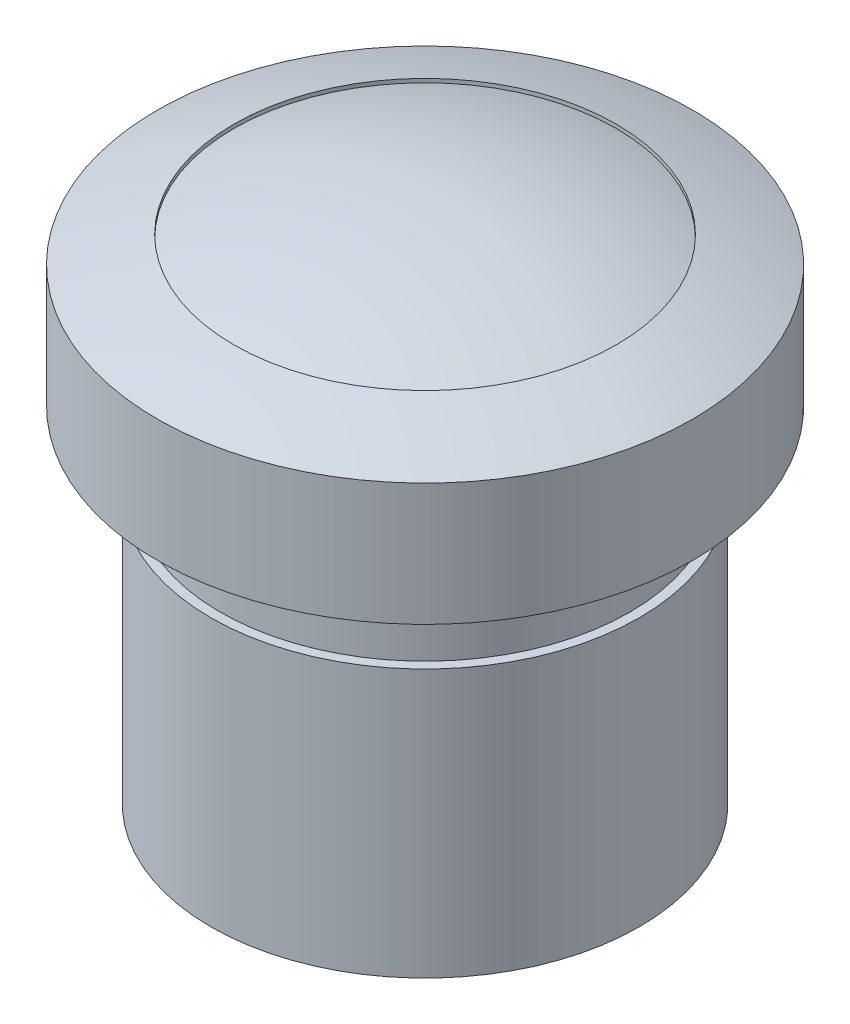
ISO-10303-21;
HEADER;
FILE_DESCRIPTION(('STEP AP214'),'2;1');
FILE_NAME('part.step','',(''),(''),'','','');
FILE_SCHEMA(('AUTOMOTIVE_DESIGN { 1 0 10303 214 1 1 1 1 }'));
ENDSEC;
DATA;
#1=APPLICATION_CONTEXT('core data for automotive mechanical design processes');
#2=APPLICATION_PROTOCOL_DEFINITION('international standard','automotive_design',2000,#1);
#3=PRODUCT_CONTEXT('',#1,'mechanical');
#4=PRODUCT('Part','Part','',(#3));
#5=PRODUCT_RELATED_PRODUCT_CATEGORY('part','',(#4));
#6=PRODUCT_DEFINITION_FORMATION('','',#4);
#7=PRODUCT_DEFINITION_CONTEXT('part definition',#1,'design');
#8=PRODUCT_DEFINITION('design','',#6,#7);
#9=PRODUCT_DEFINITION_SHAPE('','',#8);
#10=(LENGTH_UNIT() NAMED_UNIT(*) SI_UNIT(.MILLI.,.METRE.));
#11=(NAMED_UNIT(*) PLANE_ANGLE_UNIT() SI_UNIT($,.RADIAN.));
#12=(NAMED_UNIT(*) SI_UNIT($,.STERADIAN.) SOLID_ANGLE_UNIT());
#13=UNCERTAINTY_MEASURE_WITH_UNIT(LENGTH_MEASURE(1.E-05),#10,'distance_accuracy_value','');
#14=(GEOMETRIC_REPRESENTATION_CONTEXT(3) GLOBAL_UNCERTAINTY_ASSIGNED_CONTEXT((#13)) GLOBAL_UNIT_ASSIGNED_CONTEXT((#10,
#11,#12)) REPRESENTATION_CONTEXT('',''));
#15=CARTESIAN_POINT('',(0.,0.,0.));
#16=DIRECTION('',(0.,0.,1.));
#17=DIRECTION('',(1.,0.,0.));
#18=AXIS2_PLACEMENT_3D('',#15,#16,#17);
#19=CARTESIAN_POINT('',(0.,22.2735064736294,0.));
#20=DIRECTION('',(0.,-1.,0.));
#21=DIRECTION('',(0.,0.,-1.));
#22=AXIS2_PLACEMENT_3D('',#19,#20,#21);
#23=CYLINDRICAL_SURFACE('',#22,5.4);
#24=CARTESIAN_POINT('',(0.,0.,0.));
#25=DIRECTION('',(0.,-1.,0.));
#26=DIRECTION('',(0.,0.,-1.));
#27=AXIS2_PLACEMENT_3D('',#24,#25,#26);
#28=CIRCLE('',#27,5.4);
#29=CARTESIAN_POINT('',(-3.29118425669793,0.,-4.28113375035909));
#30=VERTEX_POINT('',#29);
#31=CARTESIAN_POINT('',(3.29118425669792,0.,-4.2811337503591));
#32=VERTEX_POINT('',#31);
#33=EDGE_CURVE('E313',#30,#32,#28,.T.);
#34=ORIENTED_EDGE('',*,*,#33,.T.);
#35=DIRECTION('',(0.,-1.,0.));
#36=VECTOR('',#35,1.);
#37=CARTESIAN_POINT('',(3.29118425669792,18.1088748241821,-4.2811337503591));
#38=LINE('',#37,#36);
#39=CARTESIAN_POINT('',(3.29118425669792,6.,-4.2811337503591));
#40=VERTEX_POINT('',#39);
#41=EDGE_CURVE('E222',#40,#32,#38,.T.);
#42=ORIENTED_EDGE('',*,*,#41,.F.);
#43=CARTESIAN_POINT('',(0.,6.,0.));
#44=DIRECTION('',(0.,-1.,0.));
#45=DIRECTION('',(1.,0.,0.));
#46=AXIS2_PLACEMENT_3D('',#43,#44,#45);
#47=CIRCLE('',#46,5.4);
#48=CARTESIAN_POINT('',(-3.29118425669793,6.,-4.28113375035909));
#49=VERTEX_POINT('',#48);
#50=EDGE_CURVE('E321',#40,#49,#47,.F.);
#51=ORIENTED_EDGE('',*,*,#50,.T.);
#52=DIRECTION('',(0.,-1.,0.));
#53=VECTOR('',#52,1.);
#54=CARTESIAN_POINT('',(-3.29118425669792,18.1088748241821,-4.28113375035909));
#55=LINE('',#54,#53);
#56=EDGE_CURVE('E61',#49,#30,#55,.T.);
#57=ORIENTED_EDGE('',*,*,#56,.T.);
#58=EDGE_LOOP('',(#34,#42,#51,#57));
#59=FACE_BOUND('',#58,.T.);
#60=ADVANCED_FACE('F38',(#59),#23,.F.);
#61=CARTESIAN_POINT('',(-4.28113375035909,0.,3.29118425669793));
#62=VERTEX_POINT('',#61);
#63=CARTESIAN_POINT('',(-4.28113375035909,0.,-3.29118425669793));
#64=VERTEX_POINT('',#63);
#65=EDGE_CURVE('E315',#62,#64,#28,.T.);
#66=ORIENTED_EDGE('',*,*,#65,.T.);
#67=DIRECTION('',(0.,-1.,0.));
#68=VECTOR('',#67,1.);
#69=CARTESIAN_POINT('',(-4.28113375035909,18.1088748241821,-3.29118425669793));
#70=LINE('',#69,#68);
#71=CARTESIAN_POINT('',(-4.28113375035909,6.,-3.29118425669793));
#72=VERTEX_POINT('',#71);
#73=EDGE_CURVE('E286',#72,#64,#70,.T.);
#74=ORIENTED_EDGE('',*,*,#73,.F.);
#75=CARTESIAN_POINT('',(-4.28113375035909,6.,3.29118425669793));
#76=VERTEX_POINT('',#75);
#77=EDGE_CURVE('E487',#72,#76,#47,.F.);
#78=ORIENTED_EDGE('',*,*,#77,.T.);
#79=DIRECTION('',(0.,-1.,0.));
#80=VECTOR('',#79,1.);
#81=CARTESIAN_POINT('',(-4.28113375035909,18.1088748241821,3.29118425669793));
#82=LINE('',#81,#80);
#83=EDGE_CURVE('E293',#76,#62,#82,.T.);
#84=ORIENTED_EDGE('',*,*,#83,.T.);
#85=EDGE_LOOP('',(#66,#74,#78,#84));
#86=FACE_BOUND('',#85,.T.);
#87=ADVANCED_FACE('F374',(#86),#23,.F.);
#88=CARTESIAN_POINT('',(3.29118425669793,0.,4.28113375035909));
#89=VERTEX_POINT('',#88);
#90=CARTESIAN_POINT('',(-3.29118425669792,0.,4.2811337503591));
#91=VERTEX_POINT('',#90);
#92=EDGE_CURVE('E405',#89,#91,#28,.T.);
#93=ORIENTED_EDGE('',*,*,#92,.T.);
#94=DIRECTION('',(0.,-1.,0.));
#95=VECTOR('',#94,1.);
#96=CARTESIAN_POINT('',(-3.29118425669792,18.1088748241821,4.2811337503591));
#97=LINE('',#96,#95);
#98=CARTESIAN_POINT('',(-3.29118425669792,6.,4.2811337503591));
#99=VERTEX_POINT('',#98);
#100=EDGE_CURVE('E295',#99,#91,#97,.T.);
#101=ORIENTED_EDGE('',*,*,#100,.F.);
#102=CARTESIAN_POINT('',(3.29118425669793,6.,4.28113375035909));
#103=VERTEX_POINT('',#102);
#104=EDGE_CURVE('E320',#99,#103,#47,.F.);
#105=ORIENTED_EDGE('',*,*,#104,.T.);
#106=DIRECTION('',(0.,-1.,0.));
#107=VECTOR('',#106,1.);
#108=CARTESIAN_POINT('',(3.29118425669793,18.1088748241821,4.28113375035909));
#109=LINE('',#108,#107);
#110=EDGE_CURVE('E302',#103,#89,#109,.T.);
#111=ORIENTED_EDGE('',*,*,#110,.T.);
#112=EDGE_LOOP('',(#93,#101,#105,#111));
#113=FACE_BOUND('',#112,.T.);
#114=ADVANCED_FACE('F380',(#113),#23,.F.);
#115=CARTESIAN_POINT('',(0.,6.,0.));
#116=DIRECTION('',(0.,-1.,0.));
#117=DIRECTION('',(1.,0.,0.));
#118=AXIS2_PLACEMENT_3D('',#115,#116,#117);
#119=PLANE('',#118);
#120=DIRECTION('',(-0.707106781186546,0.,0.707106781186549));
#121=VECTOR('',#120,1.);
#122=CARTESIAN_POINT('',(3.29118425669792,6.,-4.2811337503591));
#123=LINE('',#122,#121);
#124=CARTESIAN_POINT('',(1.66005050633883,6.,-2.65));
#125=VERTEX_POINT('',#124);
#126=EDGE_CURVE('E240',#40,#125,#123,.T.);
#127=ORIENTED_EDGE('',*,*,#126,.T.);
#128=DIRECTION('',(-1.,0.,0.));
#129=VECTOR('',#128,1.);
#130=CARTESIAN_POINT('',(1.66005050633883,6.,-2.65));
#131=LINE('',#130,#129);
#132=CARTESIAN_POINT('',(-1.66005050633883,6.,-2.65));
#133=VERTEX_POINT('',#132);
#134=EDGE_CURVE('E238',#125,#133,#131,.T.);
#135=ORIENTED_EDGE('',*,*,#134,.T.);
#136=DIRECTION('',(-0.707106781186547,0.,-0.707106781186548));
#137=VECTOR('',#136,1.);
#138=CARTESIAN_POINT('',(-1.66005050633883,6.,-2.65));
#139=LINE('',#138,#137);
#140=EDGE_CURVE('E236',#133,#49,#139,.T.);
#141=ORIENTED_EDGE('',*,*,#140,.T.);
#142=ORIENTED_EDGE('',*,*,#50,.F.);
#143=EDGE_LOOP('',(#127,#135,#141,#142));
#144=FACE_BOUND('',#143,.T.);
#145=ADVANCED_FACE('F393',(#144),#119,.T.);
#146=DIRECTION('',(0.707106781186548,0.,0.707106781186547));
#147=VECTOR('',#146,1.);
#148=CARTESIAN_POINT('',(-2.65,6.,-1.66005050633883));
#149=LINE('',#148,#147);
#150=CARTESIAN_POINT('',(-2.65,6.,-1.66005050633883));
#151=VERTEX_POINT('',#150);
#152=EDGE_CURVE('E234',#72,#151,#149,.T.);
#153=ORIENTED_EDGE('',*,*,#152,.T.);
#154=DIRECTION('',(0.,0.,1.));
#155=VECTOR('',#154,1.);
#156=CARTESIAN_POINT('',(-2.65,6.,-1.66005050633883));
#157=LINE('',#156,#155);
#158=CARTESIAN_POINT('',(-2.65,6.,1.66005050633883));
#159=VERTEX_POINT('',#158);
#160=EDGE_CURVE('E232',#151,#159,#157,.T.);
#161=ORIENTED_EDGE('',*,*,#160,.T.);
#162=DIRECTION('',(-0.707106781186548,0.,0.707106781186547));
#163=VECTOR('',#162,1.);
#164=CARTESIAN_POINT('',(-2.65,6.,1.66005050633883));
#165=LINE('',#164,#163);
#166=EDGE_CURVE('E230',#159,#76,#165,.T.);
#167=ORIENTED_EDGE('',*,*,#166,.T.);
#168=ORIENTED_EDGE('',*,*,#77,.F.);
#169=EDGE_LOOP('',(#153,#161,#167,#168));
#170=FACE_BOUND('',#169,.T.);
#171=ADVANCED_FACE('F402',(#170),#119,.T.);
#172=DIRECTION('',(0.707106781186546,0.,-0.707106781186549));
#173=VECTOR('',#172,1.);
#174=CARTESIAN_POINT('',(-1.66005050633883,6.,2.65));
#175=LINE('',#174,#173);
#176=CARTESIAN_POINT('',(-1.66005050633883,6.,2.65));
#177=VERTEX_POINT('',#176);
#178=EDGE_CURVE('E228',#99,#177,#175,.T.);
#179=ORIENTED_EDGE('',*,*,#178,.T.);
#180=DIRECTION('',(1.,0.,0.));
#181=VECTOR('',#180,1.);
#182=CARTESIAN_POINT('',(1.66005050633884,6.,2.65));
#183=LINE('',#182,#181);
#184=CARTESIAN_POINT('',(1.66005050633883,6.,2.65));
#185=VERTEX_POINT('',#184);
#186=EDGE_CURVE('E226',#177,#185,#183,.T.);
#187=ORIENTED_EDGE('',*,*,#186,.T.);
#188=DIRECTION('',(0.707106781186548,0.,0.707106781186547));
#189=VECTOR('',#188,1.);
#190=CARTESIAN_POINT('',(1.66005050633883,6.,2.65));
#191=LINE('',#190,#189);
#192=EDGE_CURVE('E224',#185,#103,#191,.T.);
#193=ORIENTED_EDGE('',*,*,#192,.T.);
#194=ORIENTED_EDGE('',*,*,#104,.F.);
#195=EDGE_LOOP('',(#179,#187,#193,#194));
#196=FACE_BOUND('',#195,.T.);
#197=ADVANCED_FACE('F394',(#196),#119,.T.);
#198=CARTESIAN_POINT('',(0.,9.,0.));
#199=DIRECTION('',(0.,1.,0.));
#200=DIRECTION('',(-1.,0.,0.));
#201=AXIS2_PLACEMENT_3D('',#198,#199,#200);
#202=PLANE('',#201);
#203=CARTESIAN_POINT('',(0.,9.,0.));
#204=DIRECTION('',(0.,-1.,0.));
#205=DIRECTION('',(1.,0.,0.));
#206=AXIS2_PLACEMENT_3D('',#203,#204,#205);
#207=CIRCLE('',#206,7.);
#208=CARTESIAN_POINT('',(7.,9.00000000000001,0.));
#209=VERTEX_POINT('',#208);
#210=EDGE_CURVE('E46',#209,#209,#207,.T.);
#211=ORIENTED_EDGE('',*,*,#210,.T.);
#212=EDGE_LOOP('',(#211));
#213=FACE_BOUND('',#212,.T.);
#214=CARTESIAN_POINT('',(0.,9.,0.));
#215=DIRECTION('',(0.,-1.,0.));
#216=DIRECTION('',(1.,0.,0.));
#217=AXIS2_PLACEMENT_3D('',#214,#215,#216);
#218=CIRCLE('',#217,5.35);
#219=CARTESIAN_POINT('',(5.35,9.00000000000001,0.));
#220=VERTEX_POINT('',#219);
#221=EDGE_CURVE('E326',#220,#220,#218,.T.);
#222=ORIENTED_EDGE('',*,*,#221,.F.);
#223=EDGE_LOOP('',(#222));
#224=FACE_BOUND('',#223,.T.);
#225=ADVANCED_FACE('F342',(#213,#224),#202,.F.);
#226=CARTESIAN_POINT('',(0.,9.,0.));
#227=DIRECTION('',(0.,-1.,0.));
#228=DIRECTION('',(1.,0.,0.));
#229=AXIS2_PLACEMENT_3D('',#226,#227,#228);
#230=CYLINDRICAL_SURFACE('',#229,7.);
#231=ORIENTED_EDGE('',*,*,#210,.F.);
#232=EDGE_LOOP('',(#231));
#233=FACE_BOUND('',#232,.T.);
#234=CARTESIAN_POINT('',(0.,12.2,0.));
#235=DIRECTION('',(0.,-1.,0.));
#236=DIRECTION('',(1.,0.,0.));
#237=AXIS2_PLACEMENT_3D('',#234,#235,#236);
#238=CIRCLE('',#237,7.);
#239=CARTESIAN_POINT('',(7.,12.2,0.));
#240=VERTEX_POINT('',#239);
#241=EDGE_CURVE('E337',#240,#240,#238,.T.);
#242=ORIENTED_EDGE('',*,*,#241,.T.);
#243=EDGE_LOOP('',(#242));
#244=FACE_BOUND('',#243,.T.);
#245=ADVANCED_FACE('F345',(#233,#244),#230,.T.);
#246=CARTESIAN_POINT('',(0.,-7.54699942395465,0.));
#247=DIRECTION('',(0.,-1.,0.));
#248=DIRECTION('',(1.,0.,0.));
#249=AXIS2_PLACEMENT_3D('',#246,#247,#248);
#250=DEGENERATE_TOROIDAL_SURFACE('',#249,0.84161962045238,21.2469994239546,.F.);
#251=ORIENTED_EDGE('',*,*,#241,.F.);
#252=EDGE_LOOP('',(#251));
#253=FACE_BOUND('',#252,.T.);
#254=CARTESIAN_POINT('',(0.,12.8811787799742,0.));
#255=DIRECTION('',(0.,-1.,0.));
#256=DIRECTION('',(1.,0.,0.));
#257=AXIS2_PLACEMENT_3D('',#254,#255,#256);
#258=CIRCLE('',#257,5.);
#259=CARTESIAN_POINT('',(5.,12.8811787799742,0.));
#260=VERTEX_POINT('',#259);
#261=EDGE_CURVE('E334',#260,#260,#258,.T.);
#262=ORIENTED_EDGE('',*,*,#261,.T.);
#263=EDGE_LOOP('',(#262));
#264=FACE_BOUND('',#263,.T.);
#265=ADVANCED_FACE('F348',(#253,#264),#250,.F.);
#266=CARTESIAN_POINT('',(0.,9.,0.));
#267=DIRECTION('',(0.,-1.,0.));
#268=DIRECTION('',(1.,0.,0.));
#269=AXIS2_PLACEMENT_3D('',#266,#267,#268);
#270=CYLINDRICAL_SURFACE('',#269,5.);
#271=ORIENTED_EDGE('',*,*,#261,.F.);
#272=EDGE_LOOP('',(#271));
#273=FACE_BOUND('',#272,.T.);
#274=CARTESIAN_POINT('',(0.,12.7811787799742,0.));
#275=DIRECTION('',(0.,-1.,0.));
#276=DIRECTION('',(1.,0.,0.));
#277=AXIS2_PLACEMENT_3D('',#274,#275,#276);
#278=CIRCLE('',#277,5.);
#279=CARTESIAN_POINT('',(5.,12.7811787799742,0.));
#280=VERTEX_POINT('',#279);
#281=EDGE_CURVE('E331',#280,#280,#278,.T.);
#282=ORIENTED_EDGE('',*,*,#281,.T.);
#283=EDGE_LOOP('',(#282));
#284=FACE_BOUND('',#283,.T.);
#285=ADVANCED_FACE('F354',(#273,#284),#270,.F.);
#286=CARTESIAN_POINT('',(0.,-0.363798196587588,0.));
#287=DIRECTION('',(0.,-1.,0.));
#288=DIRECTION('',(1.,0.,0.));
#289=AXIS2_PLACEMENT_3D('',#286,#287,#288);
#290=SPHERICAL_SURFACE('',#289,14.0637981965876);
#291=ORIENTED_EDGE('',*,*,#281,.F.);
#292=EDGE_LOOP('',(#291));
#293=FACE_BOUND('',#292,.T.);
#294=ADVANCED_FACE('F360',(#293),#290,.T.);
#295=CARTESIAN_POINT('',(0.,7.,0.));
#296=DIRECTION('',(0.,-1.,0.));
#297=DIRECTION('',(1.,0.,0.));
#298=AXIS2_PLACEMENT_3D('',#295,#296,#297);
#299=PLANE('',#298);
#300=CARTESIAN_POINT('',(0.,7.,0.));
#301=DIRECTION('',(0.,-1.,0.));
#302=DIRECTION('',(1.,0.,0.));
#303=AXIS2_PLACEMENT_3D('',#300,#301,#302);
#304=CIRCLE('',#303,5.6);
#305=CARTESIAN_POINT('',(5.6,7.,0.));
#306=VERTEX_POINT('',#305);
#307=EDGE_CURVE('E325',#306,#306,#304,.T.);
#308=ORIENTED_EDGE('',*,*,#307,.F.);
#309=EDGE_LOOP('',(#308));
#310=FACE_BOUND('',#309,.T.);
#311=CARTESIAN_POINT('',(0.,7.,0.));
#312=DIRECTION('',(0.,-1.,0.));
#313=DIRECTION('',(1.,0.,0.));
#314=AXIS2_PLACEMENT_3D('',#311,#312,#313);
#315=CIRCLE('',#314,5.35);
#316=CARTESIAN_POINT('',(5.35,7.,0.));
#317=VERTEX_POINT('',#316);
#318=EDGE_CURVE('E322',#317,#317,#315,.T.);
#319=ORIENTED_EDGE('',*,*,#318,.T.);
#320=EDGE_LOOP('',(#319));
#321=FACE_BOUND('',#320,.T.);
#322=ADVANCED_FACE('F365',(#310,#321),#299,.F.);
#323=CARTESIAN_POINT('',(0.,7.,0.));
#324=DIRECTION('',(0.,1.,0.));
#325=DIRECTION('',(-1.,0.,0.));
#326=AXIS2_PLACEMENT_3D('',#323,#324,#325);
#327=CYLINDRICAL_SURFACE('',#326,5.35);
#328=ORIENTED_EDGE('',*,*,#318,.F.);
#329=EDGE_LOOP('',(#328));
#330=FACE_BOUND('',#329,.T.);
#331=ORIENTED_EDGE('',*,*,#221,.T.);
#332=EDGE_LOOP('',(#331));
#333=FACE_BOUND('',#332,.T.);
#334=ADVANCED_FACE('F370',(#330,#333),#327,.T.);
#335=CARTESIAN_POINT('',(0.,0.,0.));
#336=DIRECTION('',(0.,1.,0.));
#337=DIRECTION('',(0.,0.,1.));
#338=AXIS2_PLACEMENT_3D('',#335,#336,#337);
#339=PLANE('',#338);
#340=DIRECTION('',(1.,0.,0.));
#341=VECTOR('',#340,1.);
#342=CARTESIAN_POINT('',(2.25,0.,-2.25));
#343=LINE('',#342,#341);
#344=CARTESIAN_POINT('',(-2.25,0.,-2.25));
#345=VERTEX_POINT('',#344);
#346=CARTESIAN_POINT('',(2.25,0.,-2.25));
#347=VERTEX_POINT('',#346);
#348=EDGE_CURVE('E208',#345,#347,#343,.T.);
#349=ORIENTED_EDGE('',*,*,#348,.F.);
#350=DIRECTION('',(0.,0.,-1.));
#351=VECTOR('',#350,1.);
#352=CARTESIAN_POINT('',(-2.25,0.,-2.25));
#353=LINE('',#352,#351);
#354=CARTESIAN_POINT('',(-2.25,0.,2.25));
#355=VERTEX_POINT('',#354);
#356=EDGE_CURVE('E53',#355,#345,#353,.T.);
#357=ORIENTED_EDGE('',*,*,#356,.F.);
#358=DIRECTION('',(-1.,0.,0.));
#359=VECTOR('',#358,1.);
#360=CARTESIAN_POINT('',(2.25,0.,2.25));
#361=LINE('',#360,#359);
#362=CARTESIAN_POINT('',(2.25,0.,2.25));
#363=VERTEX_POINT('',#362);
#364=EDGE_CURVE('E196',#363,#355,#361,.T.);
#365=ORIENTED_EDGE('',*,*,#364,.F.);
#366=DIRECTION('',(0.,0.,1.));
#367=VECTOR('',#366,1.);
#368=CARTESIAN_POINT('',(2.25,0.,-2.25));
#369=LINE('',#368,#367);
#370=EDGE_CURVE('E199',#347,#363,#369,.T.);
#371=ORIENTED_EDGE('',*,*,#370,.F.);
#372=EDGE_LOOP('',(#349,#357,#365,#371));
#373=FACE_BOUND('',#372,.T.);
#374=ORIENTED_EDGE('',*,*,#33,.F.);
#375=DIRECTION('',(0.707106781186547,0.,0.707106781186548));
#376=VECTOR('',#375,1.);
#377=CARTESIAN_POINT('',(-1.66005050633883,0.,-2.65));
#378=LINE('',#377,#376);
#379=CARTESIAN_POINT('',(-1.66005050633883,0.,-2.65));
#380=VERTEX_POINT('',#379);
#381=EDGE_CURVE('E269',#30,#380,#378,.T.);
#382=ORIENTED_EDGE('',*,*,#381,.T.);
#383=DIRECTION('',(1.,0.,0.));
#384=VECTOR('',#383,1.);
#385=CARTESIAN_POINT('',(1.66005050633883,0.,-2.65));
#386=LINE('',#385,#384);
#387=CARTESIAN_POINT('',(1.66005050633883,0.,-2.65));
#388=VERTEX_POINT('',#387);
#389=EDGE_CURVE('E272',#380,#388,#386,.T.);
#390=ORIENTED_EDGE('',*,*,#389,.T.);
#391=DIRECTION('',(0.707106781186546,0.,-0.707106781186549));
#392=VECTOR('',#391,1.);
#393=CARTESIAN_POINT('',(3.29118425669792,0.,-4.2811337503591));
#394=LINE('',#393,#392);
#395=EDGE_CURVE('E275',#388,#32,#394,.T.);
#396=ORIENTED_EDGE('',*,*,#395,.T.);
#397=EDGE_LOOP('',(#374,#382,#390,#396));
#398=FACE_BOUND('',#397,.T.);
#399=ORIENTED_EDGE('',*,*,#65,.F.);
#400=DIRECTION('',(0.707106781186548,0.,-0.707106781186547));
#401=VECTOR('',#400,1.);
#402=CARTESIAN_POINT('',(-2.65,0.,1.66005050633883));
#403=LINE('',#402,#401);
#404=CARTESIAN_POINT('',(-2.65,0.,1.66005050633883));
#405=VERTEX_POINT('',#404);
#406=EDGE_CURVE('E260',#62,#405,#403,.T.);
#407=ORIENTED_EDGE('',*,*,#406,.T.);
#408=DIRECTION('',(0.,0.,-1.));
#409=VECTOR('',#408,1.);
#410=CARTESIAN_POINT('',(-2.65,0.,-1.66005050633883));
#411=LINE('',#410,#409);
#412=CARTESIAN_POINT('',(-2.65,0.,-1.66005050633883));
#413=VERTEX_POINT('',#412);
#414=EDGE_CURVE('E263',#405,#413,#411,.T.);
#415=ORIENTED_EDGE('',*,*,#414,.T.);
#416=DIRECTION('',(-0.707106781186548,0.,-0.707106781186547));
#417=VECTOR('',#416,1.);
#418=CARTESIAN_POINT('',(-2.65,0.,-1.66005050633883));
#419=LINE('',#418,#417);
#420=EDGE_CURVE('E266',#413,#64,#419,.T.);
#421=ORIENTED_EDGE('',*,*,#420,.T.);
#422=EDGE_LOOP('',(#399,#407,#415,#421));
#423=FACE_BOUND('',#422,.T.);
#424=ORIENTED_EDGE('',*,*,#92,.F.);
#425=DIRECTION('',(-0.707106781186548,0.,-0.707106781186547));
#426=VECTOR('',#425,1.);
#427=CARTESIAN_POINT('',(1.66005050633883,0.,2.65));
#428=LINE('',#427,#426);
#429=CARTESIAN_POINT('',(1.66005050633883,0.,2.65));
#430=VERTEX_POINT('',#429);
#431=EDGE_CURVE('E251',#89,#430,#428,.T.);
#432=ORIENTED_EDGE('',*,*,#431,.T.);
#433=DIRECTION('',(-1.,0.,0.));
#434=VECTOR('',#433,1.);
#435=CARTESIAN_POINT('',(1.66005050633883,0.,2.65));
#436=LINE('',#435,#434);
#437=CARTESIAN_POINT('',(-1.66005050633883,0.,2.65));
#438=VERTEX_POINT('',#437);
#439=EDGE_CURVE('E254',#430,#438,#436,.T.);
#440=ORIENTED_EDGE('',*,*,#439,.T.);
#441=DIRECTION('',(-0.707106781186546,0.,0.707106781186549));
#442=VECTOR('',#441,1.);
#443=CARTESIAN_POINT('',(-1.66005050633883,0.,2.65));
#444=LINE('',#443,#442);
#445=EDGE_CURVE('E257',#438,#91,#444,.T.);
#446=ORIENTED_EDGE('',*,*,#445,.T.);
#447=EDGE_LOOP('',(#424,#432,#440,#446));
#448=FACE_BOUND('',#447,.T.);
#449=CARTESIAN_POINT('',(4.2811337503591,0.,-3.29118425669792));
#450=VERTEX_POINT('',#449);
#451=CARTESIAN_POINT('',(4.28113375035909,0.,3.29118425669793));
#452=VERTEX_POINT('',#451);
#453=EDGE_CURVE('E316',#450,#452,#28,.T.);
#454=ORIENTED_EDGE('',*,*,#453,.F.);
#455=DIRECTION('',(-0.707106781186549,0.,0.707106781186546));
#456=VECTOR('',#455,1.);
#457=CARTESIAN_POINT('',(4.2811337503591,0.,-3.29118425669792));
#458=LINE('',#457,#456);
#459=CARTESIAN_POINT('',(2.65,0.,-1.66005050633883));
#460=VERTEX_POINT('',#459);
#461=EDGE_CURVE('E215',#450,#460,#458,.T.);
#462=ORIENTED_EDGE('',*,*,#461,.T.);
#463=DIRECTION('',(0.,0.,1.));
#464=VECTOR('',#463,1.);
#465=CARTESIAN_POINT('',(2.65,0.,-1.66005050633883));
#466=LINE('',#465,#464);
#467=CARTESIAN_POINT('',(2.65,0.,1.66005050633883));
#468=VERTEX_POINT('',#467);
#469=EDGE_CURVE('E245',#460,#468,#466,.T.);
#470=ORIENTED_EDGE('',*,*,#469,.T.);
#471=DIRECTION('',(0.707106781186547,0.,0.707106781186548));
#472=VECTOR('',#471,1.);
#473=CARTESIAN_POINT('',(2.65,0.,1.66005050633883));
#474=LINE('',#473,#472);
#475=EDGE_CURVE('E248',#468,#452,#474,.T.);
#476=ORIENTED_EDGE('',*,*,#475,.T.);
#477=EDGE_LOOP('',(#454,#462,#470,#476));
#478=FACE_BOUND('',#477,.T.);
#479=CARTESIAN_POINT('',(0.,0.,0.));
#480=DIRECTION('',(0.,1.,0.));
#481=DIRECTION('',(0.,0.,1.));
#482=AXIS2_PLACEMENT_3D('',#479,#480,#481);
#483=CIRCLE('',#482,5.6);
#484=CARTESIAN_POINT('',(0.,0.,5.6));
#485=VERTEX_POINT('',#484);
#486=EDGE_CURVE('E12',#485,#485,#483,.T.);
#487=ORIENTED_EDGE('',*,*,#486,.F.);
#488=EDGE_LOOP('',(#487));
#489=FACE_BOUND('',#488,.T.);
#490=ADVANCED_FACE('F395',(#373,#398,#423,#448,#478,#489),#339,.F.);
#491=CARTESIAN_POINT('',(0.,9.,0.));
#492=DIRECTION('',(0.,-1.,0.));
#493=DIRECTION('',(0.,0.,-1.));
#494=AXIS2_PLACEMENT_3D('',#491,#492,#493);
#495=CYLINDRICAL_SURFACE('',#494,5.6);
#496=ORIENTED_EDGE('',*,*,#307,.T.);
#497=EDGE_LOOP('',(#496));
#498=FACE_BOUND('',#497,.T.);
#499=ORIENTED_EDGE('',*,*,#486,.T.);
#500=EDGE_LOOP('',(#499));
#501=FACE_BOUND('',#500,.T.);
#502=ADVANCED_FACE('F40',(#498,#501),#495,.T.);
#503=ORIENTED_EDGE('',*,*,#453,.T.);
#504=DIRECTION('',(0.,-1.,0.));
#505=VECTOR('',#504,1.);
#506=CARTESIAN_POINT('',(4.28113375035909,18.1088748241821,3.29118425669793));
#507=LINE('',#506,#505);
#508=CARTESIAN_POINT('',(4.28113375035909,6.,3.29118425669793));
#509=VERTEX_POINT('',#508);
#510=EDGE_CURVE('E304',#509,#452,#507,.T.);
#511=ORIENTED_EDGE('',*,*,#510,.F.);
#512=CARTESIAN_POINT('',(4.2811337503591,6.,-3.29118425669792));
#513=VERTEX_POINT('',#512);
#514=EDGE_CURVE('E317',#509,#513,#47,.F.);
#515=ORIENTED_EDGE('',*,*,#514,.T.);
#516=DIRECTION('',(0.,-1.,0.));
#517=VECTOR('',#516,1.);
#518=CARTESIAN_POINT('',(4.2811337503591,18.1088748241821,-3.29118425669792));
#519=LINE('',#518,#517);
#520=EDGE_CURVE('E278',#513,#450,#519,.T.);
#521=ORIENTED_EDGE('',*,*,#520,.T.);
#522=EDGE_LOOP('',(#503,#511,#515,#521));
#523=FACE_BOUND('',#522,.T.);
#524=ADVANCED_FACE('F376',(#523),#23,.F.);
#525=DIRECTION('',(-0.707106781186547,0.,-0.707106781186548));
#526=VECTOR('',#525,1.);
#527=CARTESIAN_POINT('',(2.65,6.,1.66005050633884));
#528=LINE('',#527,#526);
#529=CARTESIAN_POINT('',(2.65,6.,1.66005050633883));
#530=VERTEX_POINT('',#529);
#531=EDGE_CURVE('E221',#509,#530,#528,.T.);
#532=ORIENTED_EDGE('',*,*,#531,.T.);
#533=DIRECTION('',(0.,0.,-1.));
#534=VECTOR('',#533,1.);
#535=CARTESIAN_POINT('',(2.65,6.,-1.66005050633883));
#536=LINE('',#535,#534);
#537=CARTESIAN_POINT('',(2.65,6.,-1.66005050633883));
#538=VERTEX_POINT('',#537);
#539=EDGE_CURVE('E219',#530,#538,#536,.T.);
#540=ORIENTED_EDGE('',*,*,#539,.T.);
#541=DIRECTION('',(0.707106781186549,0.,-0.707106781186546));
#542=VECTOR('',#541,1.);
#543=CARTESIAN_POINT('',(4.2811337503591,6.,-3.29118425669792));
#544=LINE('',#543,#542);
#545=EDGE_CURVE('E242',#538,#513,#544,.T.);
#546=ORIENTED_EDGE('',*,*,#545,.T.);
#547=ORIENTED_EDGE('',*,*,#514,.F.);
#548=EDGE_LOOP('',(#532,#540,#546,#547));
#549=FACE_BOUND('',#548,.T.);
#550=ADVANCED_FACE('F385',(#549),#119,.T.);
#551=CARTESIAN_POINT('',(3.29118425669792,18.1088748241821,-4.2811337503591));
#552=DIRECTION('',(-0.707106781186549,0.,-0.707106781186546));
#553=DIRECTION('',(-0.707106781186546,0.,0.707106781186549));
#554=AXIS2_PLACEMENT_3D('',#551,#552,#553);
#555=PLANE('',#554);
#556=ORIENTED_EDGE('',*,*,#126,.F.);
#557=ORIENTED_EDGE('',*,*,#41,.T.);
#558=ORIENTED_EDGE('',*,*,#395,.F.);
#559=DIRECTION('',(0.,-1.,0.));
#560=VECTOR('',#559,1.);
#561=CARTESIAN_POINT('',(1.66005050633883,18.1088748241821,-2.65));
#562=LINE('',#561,#560);
#563=EDGE_CURVE('E281',#125,#388,#562,.T.);
#564=ORIENTED_EDGE('',*,*,#563,.F.);
#565=EDGE_LOOP('',(#556,#557,#558,#564));
#566=FACE_BOUND('',#565,.T.);
#567=ADVANCED_FACE('F391',(#566),#555,.T.);
#568=CARTESIAN_POINT('',(1.66005050633883,18.1088748241821,-2.65));
#569=DIRECTION('',(0.,0.,-1.));
#570=DIRECTION('',(-1.,0.,0.));
#571=AXIS2_PLACEMENT_3D('',#568,#569,#570);
#572=PLANE('',#571);
#573=ORIENTED_EDGE('',*,*,#134,.F.);
#574=ORIENTED_EDGE('',*,*,#563,.T.);
#575=ORIENTED_EDGE('',*,*,#389,.F.);
#576=DIRECTION('',(0.,-1.,0.));
#577=VECTOR('',#576,1.);
#578=CARTESIAN_POINT('',(-1.66005050633883,18.1088748241821,-2.65));
#579=LINE('',#578,#577);
#580=EDGE_CURVE('E283',#133,#380,#579,.T.);
#581=ORIENTED_EDGE('',*,*,#580,.F.);
#582=EDGE_LOOP('',(#573,#574,#575,#581));
#583=FACE_BOUND('',#582,.T.);
#584=ADVANCED_FACE('F515',(#583),#572,.T.);
#585=CARTESIAN_POINT('',(-1.66005050633883,18.1088748241821,-2.65));
#586=DIRECTION('',(0.707106781186548,0.,-0.707106781186547));
#587=DIRECTION('',(-0.707106781186547,0.,-0.707106781186548));
#588=AXIS2_PLACEMENT_3D('',#585,#586,#587);
#589=PLANE('',#588);
#590=ORIENTED_EDGE('',*,*,#140,.F.);
#591=ORIENTED_EDGE('',*,*,#580,.T.);
#592=ORIENTED_EDGE('',*,*,#381,.F.);
#593=ORIENTED_EDGE('',*,*,#56,.F.);
#594=EDGE_LOOP('',(#590,#591,#592,#593));
#595=FACE_BOUND('',#594,.T.);
#596=ADVANCED_FACE('F507',(#595),#589,.T.);
#597=CARTESIAN_POINT('',(-2.65,18.1088748241821,-1.66005050633883));
#598=DIRECTION('',(-0.707106781186547,0.,0.707106781186548));
#599=DIRECTION('',(0.707106781186548,0.,0.707106781186547));
#600=AXIS2_PLACEMENT_3D('',#597,#598,#599);
#601=PLANE('',#600);
#602=ORIENTED_EDGE('',*,*,#152,.F.);
#603=ORIENTED_EDGE('',*,*,#73,.T.);
#604=ORIENTED_EDGE('',*,*,#420,.F.);
#605=DIRECTION('',(0.,-1.,0.));
#606=VECTOR('',#605,1.);
#607=CARTESIAN_POINT('',(-2.65,18.1088748241821,-1.66005050633883));
#608=LINE('',#607,#606);
#609=EDGE_CURVE('E289',#151,#413,#608,.T.);
#610=ORIENTED_EDGE('',*,*,#609,.F.);
#611=EDGE_LOOP('',(#602,#603,#604,#610));
#612=FACE_BOUND('',#611,.T.);
#613=ADVANCED_FACE('F495',(#612),#601,.T.);
#614=CARTESIAN_POINT('',(-2.65,18.1088748241821,-1.66005050633883));
#615=DIRECTION('',(-1.,0.,0.));
#616=DIRECTION('',(0.,0.,1.));
#617=AXIS2_PLACEMENT_3D('',#614,#615,#616);
#618=PLANE('',#617);
#619=ORIENTED_EDGE('',*,*,#160,.F.);
#620=ORIENTED_EDGE('',*,*,#609,.T.);
#621=ORIENTED_EDGE('',*,*,#414,.F.);
#622=DIRECTION('',(0.,-1.,0.));
#623=VECTOR('',#622,1.);
#624=CARTESIAN_POINT('',(-2.65,18.1088748241821,1.66005050633883));
#625=LINE('',#624,#623);
#626=EDGE_CURVE('E291',#159,#405,#625,.T.);
#627=ORIENTED_EDGE('',*,*,#626,.F.);
#628=EDGE_LOOP('',(#619,#620,#621,#627));
#629=FACE_BOUND('',#628,.T.);
#630=ADVANCED_FACE('F492',(#629),#618,.T.);
#631=CARTESIAN_POINT('',(-2.65,18.1088748241821,1.66005050633883));
#632=DIRECTION('',(-0.707106781186547,0.,-0.707106781186548));
#633=DIRECTION('',(-0.707106781186548,0.,0.707106781186547));
#634=AXIS2_PLACEMENT_3D('',#631,#632,#633);
#635=PLANE('',#634);
#636=ORIENTED_EDGE('',*,*,#166,.F.);
#637=ORIENTED_EDGE('',*,*,#626,.T.);
#638=ORIENTED_EDGE('',*,*,#406,.F.);
#639=ORIENTED_EDGE('',*,*,#83,.F.);
#640=EDGE_LOOP('',(#636,#637,#638,#639));
#641=FACE_BOUND('',#640,.T.);
#642=ADVANCED_FACE('F501',(#641),#635,.T.);
#643=CARTESIAN_POINT('',(-1.66005050633883,18.1088748241821,2.65));
#644=DIRECTION('',(0.707106781186549,0.,0.707106781186546));
#645=DIRECTION('',(0.707106781186546,0.,-0.707106781186549));
#646=AXIS2_PLACEMENT_3D('',#643,#644,#645);
#647=PLANE('',#646);
#648=ORIENTED_EDGE('',*,*,#178,.F.);
#649=ORIENTED_EDGE('',*,*,#100,.T.);
#650=ORIENTED_EDGE('',*,*,#445,.F.);
#651=DIRECTION('',(0.,-1.,0.));
#652=VECTOR('',#651,1.);
#653=CARTESIAN_POINT('',(-1.66005050633883,18.1088748241821,2.65));
#654=LINE('',#653,#652);
#655=EDGE_CURVE('E298',#177,#438,#654,.T.);
#656=ORIENTED_EDGE('',*,*,#655,.F.);
#657=EDGE_LOOP('',(#648,#649,#650,#656));
#658=FACE_BOUND('',#657,.T.);
#659=ADVANCED_FACE('F414',(#658),#647,.T.);
#660=CARTESIAN_POINT('',(1.66005050633883,18.1088748241821,2.65));
#661=DIRECTION('',(0.,0.,1.));
#662=DIRECTION('',(1.,0.,0.));
#663=AXIS2_PLACEMENT_3D('',#660,#661,#662);
#664=PLANE('',#663);
#665=ORIENTED_EDGE('',*,*,#186,.F.);
#666=ORIENTED_EDGE('',*,*,#655,.T.);
#667=ORIENTED_EDGE('',*,*,#439,.F.);
#668=DIRECTION('',(0.,-1.,0.));
#669=VECTOR('',#668,1.);
#670=CARTESIAN_POINT('',(1.66005050633883,18.1088748241821,2.65));
#671=LINE('',#670,#669);
#672=EDGE_CURVE('E300',#185,#430,#671,.T.);
#673=ORIENTED_EDGE('',*,*,#672,.F.);
#674=EDGE_LOOP('',(#665,#666,#667,#673));
#675=FACE_BOUND('',#674,.T.);
#676=ADVANCED_FACE('F421',(#675),#664,.T.);
#677=CARTESIAN_POINT('',(1.66005050633883,18.1088748241821,2.65));
#678=DIRECTION('',(-0.707106781186547,0.,0.707106781186548));
#679=DIRECTION('',(0.707106781186548,0.,0.707106781186547));
#680=AXIS2_PLACEMENT_3D('',#677,#678,#679);
#681=PLANE('',#680);
#682=ORIENTED_EDGE('',*,*,#192,.F.);
#683=ORIENTED_EDGE('',*,*,#672,.T.);
#684=ORIENTED_EDGE('',*,*,#431,.F.);
#685=ORIENTED_EDGE('',*,*,#110,.F.);
#686=EDGE_LOOP('',(#682,#683,#684,#685));
#687=FACE_BOUND('',#686,.T.);
#688=ADVANCED_FACE('F425',(#687),#681,.T.);
#689=CARTESIAN_POINT('',(2.65,18.1088748241821,1.66005050633883));
#690=DIRECTION('',(0.707106781186548,0.,-0.707106781186547));
#691=DIRECTION('',(-0.707106781186547,0.,-0.707106781186548));
#692=AXIS2_PLACEMENT_3D('',#689,#690,#691);
#693=PLANE('',#692);
#694=ORIENTED_EDGE('',*,*,#531,.F.);
#695=ORIENTED_EDGE('',*,*,#510,.T.);
#696=ORIENTED_EDGE('',*,*,#475,.F.);
#697=DIRECTION('',(0.,-1.,0.));
#698=VECTOR('',#697,1.);
#699=CARTESIAN_POINT('',(2.65,18.1088748241821,1.66005050633883));
#700=LINE('',#699,#698);
#701=EDGE_CURVE('E307',#530,#468,#700,.T.);
#702=ORIENTED_EDGE('',*,*,#701,.F.);
#703=EDGE_LOOP('',(#694,#695,#696,#702));
#704=FACE_BOUND('',#703,.T.);
#705=ADVANCED_FACE('F427',(#704),#693,.T.);
#706=CARTESIAN_POINT('',(2.65,18.1088748241821,-1.66005050633883));
#707=DIRECTION('',(1.,0.,0.));
#708=DIRECTION('',(0.,0.,-1.));
#709=AXIS2_PLACEMENT_3D('',#706,#707,#708);
#710=PLANE('',#709);
#711=ORIENTED_EDGE('',*,*,#539,.F.);
#712=ORIENTED_EDGE('',*,*,#701,.T.);
#713=ORIENTED_EDGE('',*,*,#469,.F.);
#714=DIRECTION('',(0.,-1.,0.));
#715=VECTOR('',#714,1.);
#716=CARTESIAN_POINT('',(2.65,18.1088748241821,-1.66005050633883));
#717=LINE('',#716,#715);
#718=EDGE_CURVE('E309',#538,#460,#717,.T.);
#719=ORIENTED_EDGE('',*,*,#718,.F.);
#720=EDGE_LOOP('',(#711,#712,#713,#719));
#721=FACE_BOUND('',#720,.T.);
#722=ADVANCED_FACE('F433',(#721),#710,.T.);
#723=CARTESIAN_POINT('',(4.2811337503591,18.1088748241821,-3.29118425669792));
#724=DIRECTION('',(0.707106781186546,0.,0.707106781186549));
#725=DIRECTION('',(0.707106781186549,0.,-0.707106781186546));
#726=AXIS2_PLACEMENT_3D('',#723,#724,#725);
#727=PLANE('',#726);
#728=ORIENTED_EDGE('',*,*,#545,.F.);
#729=ORIENTED_EDGE('',*,*,#718,.T.);
#730=ORIENTED_EDGE('',*,*,#461,.F.);
#731=ORIENTED_EDGE('',*,*,#520,.F.);
#732=EDGE_LOOP('',(#728,#729,#730,#731));
#733=FACE_BOUND('',#732,.T.);
#734=ADVANCED_FACE('F441',(#733),#727,.T.);
#735=CARTESIAN_POINT('',(-2.25,0.8,-2.25));
#736=DIRECTION('',(-1.,0.,0.));
#737=DIRECTION('',(0.,0.,1.));
#738=AXIS2_PLACEMENT_3D('',#735,#736,#737);
#739=PLANE('',#738);
#740=ORIENTED_EDGE('',*,*,#356,.T.);
#741=DIRECTION('',(0.,-1.,0.));
#742=VECTOR('',#741,1.);
#743=CARTESIAN_POINT('',(-2.25,0.8,-2.25));
#744=LINE('',#743,#742);
#745=CARTESIAN_POINT('',(-2.25,0.8,-2.25));
#746=VERTEX_POINT('',#745);
#747=EDGE_CURVE('E174',#746,#345,#744,.T.);
#748=ORIENTED_EDGE('',*,*,#747,.F.);
#749=DIRECTION('',(0.,0.,-1.));
#750=VECTOR('',#749,1.);
#751=CARTESIAN_POINT('',(-2.25,0.8,-2.25));
#752=LINE('',#751,#750);
#753=CARTESIAN_POINT('',(-2.25,0.8,2.25));
#754=VERTEX_POINT('',#753);
#755=EDGE_CURVE('E178',#754,#746,#752,.T.);
#756=ORIENTED_EDGE('',*,*,#755,.F.);
#757=DIRECTION('',(0.,-1.,0.));
#758=VECTOR('',#757,1.);
#759=CARTESIAN_POINT('',(-2.25,0.8,2.25));
#760=LINE('',#759,#758);
#761=EDGE_CURVE('E213',#754,#355,#760,.T.);
#762=ORIENTED_EDGE('',*,*,#761,.T.);
#763=EDGE_LOOP('',(#740,#748,#756,#762));
#764=FACE_BOUND('',#763,.T.);
#765=ADVANCED_FACE('F176',(#764),#739,.F.);
#766=CARTESIAN_POINT('',(2.25,0.8,2.25));
#767=DIRECTION('',(0.,0.,1.));
#768=DIRECTION('',(1.,0.,0.));
#769=AXIS2_PLACEMENT_3D('',#766,#767,#768);
#770=PLANE('',#769);
#771=ORIENTED_EDGE('',*,*,#364,.T.);
#772=ORIENTED_EDGE('',*,*,#761,.F.);
#773=DIRECTION('',(-1.,0.,0.));
#774=VECTOR('',#773,1.);
#775=CARTESIAN_POINT('',(2.25,0.8,2.25));
#776=LINE('',#775,#774);
#777=CARTESIAN_POINT('',(2.25,0.8,2.25));
#778=VERTEX_POINT('',#777);
#779=EDGE_CURVE('E184',#778,#754,#776,.T.);
#780=ORIENTED_EDGE('',*,*,#779,.F.);
#781=DIRECTION('',(0.,-1.,0.));
#782=VECTOR('',#781,1.);
#783=CARTESIAN_POINT('',(2.25,0.8,2.25));
#784=LINE('',#783,#782);
#785=EDGE_CURVE('E216',#778,#363,#784,.T.);
#786=ORIENTED_EDGE('',*,*,#785,.T.);
#787=EDGE_LOOP('',(#771,#772,#780,#786));
#788=FACE_BOUND('',#787,.T.);
#789=ADVANCED_FACE('F448',(#788),#770,.F.);
#790=CARTESIAN_POINT('',(2.25,0.8,-2.25));
#791=DIRECTION('',(1.,0.,0.));
#792=DIRECTION('',(0.,0.,-1.));
#793=AXIS2_PLACEMENT_3D('',#790,#791,#792);
#794=PLANE('',#793);
#795=ORIENTED_EDGE('',*,*,#370,.T.);
#796=ORIENTED_EDGE('',*,*,#785,.F.);
#797=DIRECTION('',(0.,0.,1.));
#798=VECTOR('',#797,1.);
#799=CARTESIAN_POINT('',(2.25,0.8,-2.25));
#800=LINE('',#799,#798);
#801=CARTESIAN_POINT('',(2.25,0.8,-2.25));
#802=VERTEX_POINT('',#801);
#803=EDGE_CURVE('E192',#802,#778,#800,.T.);
#804=ORIENTED_EDGE('',*,*,#803,.F.);
#805=DIRECTION('',(0.,-1.,0.));
#806=VECTOR('',#805,1.);
#807=CARTESIAN_POINT('',(2.25,0.8,-2.25));
#808=LINE('',#807,#806);
#809=EDGE_CURVE('E183',#802,#347,#808,.T.);
#810=ORIENTED_EDGE('',*,*,#809,.T.);
#811=EDGE_LOOP('',(#795,#796,#804,#810));
#812=FACE_BOUND('',#811,.T.);
#813=ADVANCED_FACE('F581',(#812),#794,.F.);
#814=CARTESIAN_POINT('',(2.25,0.8,-2.25));
#815=DIRECTION('',(0.,0.,-1.));
#816=DIRECTION('',(-1.,0.,0.));
#817=AXIS2_PLACEMENT_3D('',#814,#815,#816);
#818=PLANE('',#817);
#819=ORIENTED_EDGE('',*,*,#348,.T.);
#820=ORIENTED_EDGE('',*,*,#809,.F.);
#821=DIRECTION('',(1.,0.,0.));
#822=VECTOR('',#821,1.);
#823=CARTESIAN_POINT('',(2.25,0.8,-2.25));
#824=LINE('',#823,#822);
#825=EDGE_CURVE('E187',#746,#802,#824,.T.);
#826=ORIENTED_EDGE('',*,*,#825,.F.);
#827=ORIENTED_EDGE('',*,*,#747,.T.);
#828=EDGE_LOOP('',(#819,#820,#826,#827));
#829=FACE_BOUND('',#828,.T.);
#830=ADVANCED_FACE('F188',(#829),#818,.F.);
#831=CARTESIAN_POINT('',(0.,0.8,0.));
#832=DIRECTION('',(0.,-1.,0.));
#833=DIRECTION('',(0.,0.,-1.));
#834=AXIS2_PLACEMENT_3D('',#831,#832,#833);
#835=PLANE('',#834);
#836=CARTESIAN_POINT('',(0.,0.8,0.));
#837=DIRECTION('',(0.,-1.,0.));
#838=DIRECTION('',(0.,0.,-1.));
#839=AXIS2_PLACEMENT_3D('',#836,#837,#838);
#840=CIRCLE('',#839,1.75);
#841=CARTESIAN_POINT('',(0.,0.8,-1.75));
#842=VERTEX_POINT('',#841);
#843=EDGE_CURVE('E202',#842,#842,#840,.T.);
#844=ORIENTED_EDGE('',*,*,#843,.F.);
#845=EDGE_LOOP('',(#844));
#846=FACE_BOUND('',#845,.T.);
#847=ORIENTED_EDGE('',*,*,#755,.T.);
#848=ORIENTED_EDGE('',*,*,#825,.T.);
#849=ORIENTED_EDGE('',*,*,#803,.T.);
#850=ORIENTED_EDGE('',*,*,#779,.T.);
#851=EDGE_LOOP('',(#847,#848,#849,#850));
#852=FACE_BOUND('',#851,.T.);
#853=ADVANCED_FACE('F194',(#846,#852),#835,.T.);
#854=CARTESIAN_POINT('',(0.,1.8,0.));
#855=DIRECTION('',(0.,-1.,0.));
#856=DIRECTION('',(0.,0.,-1.));
#857=AXIS2_PLACEMENT_3D('',#854,#855,#856);
#858=CYLINDRICAL_SURFACE('',#857,1.75);
#859=CARTESIAN_POINT('',(0.,1.8,0.));
#860=DIRECTION('',(0.,-1.,0.));
#861=DIRECTION('',(0.,0.,-1.));
#862=AXIS2_PLACEMENT_3D('',#859,#860,#861);
#863=CIRCLE('',#862,1.75);
#864=CARTESIAN_POINT('',(0.,1.8,-1.75));
#865=VERTEX_POINT('',#864);
#866=EDGE_CURVE('E209',#865,#865,#863,.T.);
#867=ORIENTED_EDGE('',*,*,#866,.F.);
#868=EDGE_LOOP('',(#867));
#869=FACE_BOUND('',#868,.T.);
#870=ORIENTED_EDGE('',*,*,#843,.T.);
#871=EDGE_LOOP('',(#870));
#872=FACE_BOUND('',#871,.T.);
#873=ADVANCED_FACE('F608',(#869,#872),#858,.F.);
#874=CARTESIAN_POINT('',(0.,2.83125,0.));
#875=DIRECTION('',(0.,-1.,0.));
#876=DIRECTION('',(-1.,0.,0.));
#877=AXIS2_PLACEMENT_3D('',#874,#875,#876);
#878=SPHERICAL_SURFACE('',#877,2.03125);
#879=ORIENTED_EDGE('',*,*,#866,.T.);
#880=EDGE_LOOP('',(#879));
#881=FACE_BOUND('',#880,.T.);
#882=ADVANCED_FACE('F618',(#881),#878,.T.);
#883=CLOSED_SHELL('',(#60,#87,#114,#145,#171,#197,#225,#245,#265,#285,#294,#322,#334,#490,#502,
#524,#550,#567,#584,#596,#613,#630,#642,#659,#676,#688,#705,#722,#734,#765,#789,#813,#830,#853,
#873,#882));
#884=MANIFOLD_SOLID_BREP('B2',#883);
#885=ADVANCED_BREP_SHAPE_REPRESENTATION('',(#18,#884),#14);
#886=SHAPE_DEFINITION_REPRESENTATION(#9,#885);
ENDSEC;
END-ISO-10303-21;
